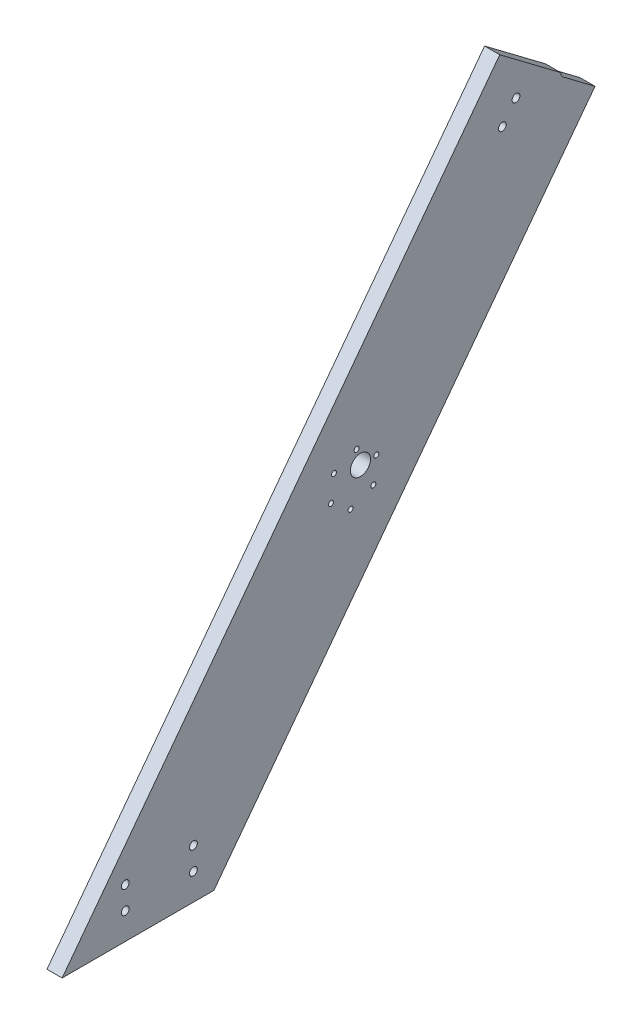
ISO-10303-21;
HEADER;
FILE_DESCRIPTION(('STEP AP214'),'2;1');
FILE_NAME('part.step','',(''),(''),'','','');
FILE_SCHEMA(('AUTOMOTIVE_DESIGN { 1 0 10303 214 1 1 1 1 }'));
ENDSEC;
DATA;
#1=APPLICATION_CONTEXT('core data for automotive mechanical design processes');
#2=APPLICATION_PROTOCOL_DEFINITION('international standard','automotive_design',2000,#1);
#3=PRODUCT_CONTEXT('',#1,'mechanical');
#4=PRODUCT('Part','Part','',(#3));
#5=PRODUCT_RELATED_PRODUCT_CATEGORY('part','',(#4));
#6=PRODUCT_DEFINITION_FORMATION('','',#4);
#7=PRODUCT_DEFINITION_CONTEXT('part definition',#1,'design');
#8=PRODUCT_DEFINITION('design','',#6,#7);
#9=PRODUCT_DEFINITION_SHAPE('','',#8);
#10=(LENGTH_UNIT() NAMED_UNIT(*) SI_UNIT(.MILLI.,.METRE.));
#11=(NAMED_UNIT(*) PLANE_ANGLE_UNIT() SI_UNIT($,.RADIAN.));
#12=(NAMED_UNIT(*) SI_UNIT($,.STERADIAN.) SOLID_ANGLE_UNIT());
#13=UNCERTAINTY_MEASURE_WITH_UNIT(LENGTH_MEASURE(1.E-05),#10,'distance_accuracy_value','');
#14=(GEOMETRIC_REPRESENTATION_CONTEXT(3) GLOBAL_UNCERTAINTY_ASSIGNED_CONTEXT((#13)) GLOBAL_UNIT_ASSIGNED_CONTEXT((#10,
#11,#12)) REPRESENTATION_CONTEXT('',''));
#15=CARTESIAN_POINT('',(0.,0.,0.));
#16=DIRECTION('',(0.,0.,1.));
#17=DIRECTION('',(1.,0.,0.));
#18=AXIS2_PLACEMENT_3D('',#15,#16,#17);
#19=CARTESIAN_POINT('',(9.525,0.,-95.412737151503));
#20=DIRECTION('',(0.,1.,0.));
#21=DIRECTION('',(0.,0.,1.));
#22=AXIS2_PLACEMENT_3D('',#19,#20,#21);
#23=PLANE('',#22);
#24=DIRECTION('',(0.,0.,-1.));
#25=VECTOR('',#24,1.);
#26=CARTESIAN_POINT('',(0.,0.,-95.412737151503));
#27=LINE('',#26,#25);
#28=CARTESIAN_POINT('',(0.,0.,0.));
#29=VERTEX_POINT('',#28);
#30=CARTESIAN_POINT('',(0.,0.,-95.412737151503));
#31=VERTEX_POINT('',#30);
#32=EDGE_CURVE('E123',#29,#31,#27,.T.);
#33=ORIENTED_EDGE('',*,*,#32,.T.);
#34=DIRECTION('',(-1.,0.,0.));
#35=VECTOR('',#34,1.);
#36=CARTESIAN_POINT('',(9.525,0.,-95.412737151503));
#37=LINE('',#36,#35);
#38=CARTESIAN_POINT('',(9.525,0.,-95.412737151503));
#39=VERTEX_POINT('',#38);
#40=EDGE_CURVE('E11',#39,#31,#37,.T.);
#41=ORIENTED_EDGE('',*,*,#40,.F.);
#42=DIRECTION('',(0.,0.,-1.));
#43=VECTOR('',#42,1.);
#44=CARTESIAN_POINT('',(9.525,0.,-95.412737151503));
#45=LINE('',#44,#43);
#46=CARTESIAN_POINT('',(9.525,0.,0.));
#47=VERTEX_POINT('',#46);
#48=EDGE_CURVE('E120',#47,#39,#45,.T.);
#49=ORIENTED_EDGE('',*,*,#48,.F.);
#50=DIRECTION('',(-1.,0.,0.));
#51=VECTOR('',#50,1.);
#52=CARTESIAN_POINT('',(9.525,0.,0.));
#53=LINE('',#52,#51);
#54=EDGE_CURVE('E127',#47,#29,#53,.T.);
#55=ORIENTED_EDGE('',*,*,#54,.T.);
#56=EDGE_LOOP('',(#33,#41,#49,#55));
#57=FACE_BOUND('',#56,.T.);
#58=ADVANCED_FACE('F37',(#57),#23,.F.);
#59=CARTESIAN_POINT('',(9.525,319.277850429435,-336.005854450722));
#60=DIRECTION('',(0.,0.601815023152055,0.798635510047288));
#61=DIRECTION('',(0.,-0.798635510047288,0.601815023152055));
#62=AXIS2_PLACEMENT_3D('',#59,#60,#61);
#63=PLANE('',#62);
#64=DIRECTION('',(0.,0.798635510047288,-0.601815023152055));
#65=VECTOR('',#64,1.);
#66=CARTESIAN_POINT('',(0.,319.277850429435,-336.005854450722));
#67=LINE('',#66,#65);
#68=CARTESIAN_POINT('',(0.,318.010016557235,-335.050473101468));
#69=VERTEX_POINT('',#68);
#70=EDGE_CURVE('E118',#31,#69,#67,.T.);
#71=ORIENTED_EDGE('',*,*,#70,.T.);
#72=DIRECTION('',(1.,0.,0.));
#73=VECTOR('',#72,1.);
#74=CARTESIAN_POINT('',(0.,318.010016557235,-335.050473101468));
#75=LINE('',#74,#73);
#76=CARTESIAN_POINT('',(9.525,318.010016557235,-335.050473101468));
#77=VERTEX_POINT('',#76);
#78=EDGE_CURVE('E134',#69,#77,#75,.T.);
#79=ORIENTED_EDGE('',*,*,#78,.T.);
#80=DIRECTION('',(0.,0.798635510047288,-0.601815023152055));
#81=VECTOR('',#80,1.);
#82=CARTESIAN_POINT('',(9.525,319.277850429435,-336.005854450722));
#83=LINE('',#82,#81);
#84=EDGE_CURVE('E83',#39,#77,#83,.T.);
#85=ORIENTED_EDGE('',*,*,#84,.F.);
#86=ORIENTED_EDGE('',*,*,#40,.T.);
#87=EDGE_LOOP('',(#71,#79,#85,#86));
#88=FACE_BOUND('',#87,.T.);
#89=ADVANCED_FACE('F144',(#88),#63,.F.);
#90=CARTESIAN_POINT('',(9.525,365.136155193621,-275.149828585118));
#91=DIRECTION('',(0.,-0.79863551004729,0.601815023152052));
#92=DIRECTION('',(0.,-0.601815023152052,-0.79863551004729));
#93=AXIS2_PLACEMENT_3D('',#90,#91,#92);
#94=PLANE('',#93);
#95=DIRECTION('',(0.,0.601815023152052,0.79863551004729));
#96=VECTOR('',#95,1.);
#97=CARTESIAN_POINT('',(9.525,365.136155193621,-275.149828585118));
#98=LINE('',#97,#96);
#99=CARTESIAN_POINT('',(9.525,336.218721055008,-313.524559813313));
#100=VERTEX_POINT('',#99);
#101=CARTESIAN_POINT('',(9.525,365.136155193621,-275.149828585118));
#102=VERTEX_POINT('',#101);
#103=EDGE_CURVE('E114',#100,#102,#98,.T.);
#104=ORIENTED_EDGE('',*,*,#103,.F.);
#105=DIRECTION('',(1.,0.,0.));
#106=VECTOR('',#105,1.);
#107=CARTESIAN_POINT('',(0.,336.218721055008,-313.524559813313));
#108=LINE('',#107,#106);
#109=CARTESIAN_POINT('',(0.,336.218721055008,-313.524559813313));
#110=VERTEX_POINT('',#109);
#111=EDGE_CURVE('E102',#110,#100,#108,.T.);
#112=ORIENTED_EDGE('',*,*,#111,.F.);
#113=DIRECTION('',(0.,0.601815023152052,0.79863551004729));
#114=VECTOR('',#113,1.);
#115=CARTESIAN_POINT('',(0.,365.136155193621,-275.149828585118));
#116=LINE('',#115,#114);
#117=CARTESIAN_POINT('',(0.,365.136155193621,-275.149828585118));
#118=VERTEX_POINT('',#117);
#119=EDGE_CURVE('E113',#110,#118,#116,.T.);
#120=ORIENTED_EDGE('',*,*,#119,.T.);
#121=DIRECTION('',(-1.,0.,0.));
#122=VECTOR('',#121,1.);
#123=CARTESIAN_POINT('',(9.525,365.136155193621,-275.149828585118));
#124=LINE('',#123,#122);
#125=EDGE_CURVE('E44',#102,#118,#124,.T.);
#126=ORIENTED_EDGE('',*,*,#125,.F.);
#127=EDGE_LOOP('',(#104,#112,#120,#126));
#128=FACE_BOUND('',#127,.T.);
#129=ADVANCED_FACE('F111',(#128),#94,.F.);
#130=CARTESIAN_POINT('',(9.525,0.,0.));
#131=DIRECTION('',(0.,-0.601815023152052,-0.79863551004729));
#132=DIRECTION('',(0.,0.79863551004729,-0.601815023152052));
#133=AXIS2_PLACEMENT_3D('',#130,#131,#132);
#134=PLANE('',#133);
#135=DIRECTION('',(0.,-0.79863551004729,0.601815023152052));
#136=VECTOR('',#135,1.);
#137=CARTESIAN_POINT('',(0.,0.,0.));
#138=LINE('',#137,#136);
#139=EDGE_CURVE('E77',#118,#29,#138,.T.);
#140=ORIENTED_EDGE('',*,*,#139,.T.);
#141=ORIENTED_EDGE('',*,*,#54,.F.);
#142=DIRECTION('',(0.,-0.79863551004729,0.601815023152052));
#143=VECTOR('',#142,1.);
#144=CARTESIAN_POINT('',(9.525,0.,0.));
#145=LINE('',#144,#143);
#146=EDGE_CURVE('E60',#102,#47,#145,.T.);
#147=ORIENTED_EDGE('',*,*,#146,.F.);
#148=ORIENTED_EDGE('',*,*,#125,.T.);
#149=EDGE_LOOP('',(#140,#141,#147,#148));
#150=FACE_BOUND('',#149,.T.);
#151=ADVANCED_FACE('F128',(#150),#134,.F.);
#152=CARTESIAN_POINT('',(9.525,0.,0.));
#153=DIRECTION('',(-1.,0.,0.));
#154=DIRECTION('',(0.,0.,1.));
#155=AXIS2_PLACEMENT_3D('',#152,#153,#154);
#156=PLANE('',#155);
#157=CARTESIAN_POINT('',(9.525,336.461727915126,-285.346343492198));
#158=DIRECTION('',(1.,0.,0.));
#159=DIRECTION('',(0.,0.,-1.));
#160=AXIS2_PLACEMENT_3D('',#157,#158,#159);
#161=CIRCLE('',#160,2.4638);
#162=CARTESIAN_POINT('',(9.525,336.461727915126,-287.810143492198));
#163=VERTEX_POINT('',#162);
#164=EDGE_CURVE('E214',#163,#163,#161,.T.);
#165=ORIENTED_EDGE('',*,*,#164,.F.);
#166=EDGE_LOOP('',(#165));
#167=FACE_BOUND('',#166,.T.);
#168=CARTESIAN_POINT('',(9.525,16.764,-82.55));
#169=DIRECTION('',(1.,0.,0.));
#170=DIRECTION('',(0.,0.,-1.));
#171=AXIS2_PLACEMENT_3D('',#168,#169,#170);
#172=CIRCLE('',#171,2.4638);
#173=CARTESIAN_POINT('',(9.525,16.764,-85.0138));
#174=VERTEX_POINT('',#173);
#175=EDGE_CURVE('E203',#174,#174,#172,.T.);
#176=ORIENTED_EDGE('',*,*,#175,.F.);
#177=EDGE_LOOP('',(#176));
#178=FACE_BOUND('',#177,.T.);
#179=CARTESIAN_POINT('',(9.525,30.988,-82.55));
#180=DIRECTION('',(1.,0.,0.));
#181=DIRECTION('',(0.,0.,-1.));
#182=AXIS2_PLACEMENT_3D('',#179,#180,#181);
#183=CIRCLE('',#182,2.4638);
#184=CARTESIAN_POINT('',(9.525,30.988,-85.0138));
#185=VERTEX_POINT('',#184);
#186=EDGE_CURVE('E202',#185,#185,#183,.T.);
#187=ORIENTED_EDGE('',*,*,#186,.F.);
#188=EDGE_LOOP('',(#187));
#189=FACE_BOUND('',#188,.T.);
#190=CARTESIAN_POINT('',(9.525,30.988,-39.6875));
#191=DIRECTION('',(1.,0.,0.));
#192=DIRECTION('',(0.,0.,-1.));
#193=AXIS2_PLACEMENT_3D('',#190,#191,#192);
#194=CIRCLE('',#193,2.4638);
#195=CARTESIAN_POINT('',(9.525,30.988,-42.1513));
#196=VERTEX_POINT('',#195);
#197=EDGE_CURVE('E196',#196,#196,#194,.T.);
#198=ORIENTED_EDGE('',*,*,#197,.F.);
#199=EDGE_LOOP('',(#198));
#200=FACE_BOUND('',#199,.T.);
#201=CARTESIAN_POINT('',(9.525,325.101936420213,-276.786126602884));
#202=DIRECTION('',(1.,0.,0.));
#203=DIRECTION('',(0.,0.,-1.));
#204=AXIS2_PLACEMENT_3D('',#201,#202,#203);
#205=CIRCLE('',#204,2.4638);
#206=CARTESIAN_POINT('',(9.525,325.101936420213,-279.249926602884));
#207=VERTEX_POINT('',#206);
#208=EDGE_CURVE('E215',#207,#207,#205,.T.);
#209=ORIENTED_EDGE('',*,*,#208,.F.);
#210=EDGE_LOOP('',(#209));
#211=FACE_BOUND('',#210,.T.);
#212=CARTESIAN_POINT('',(9.525,16.764,-39.6875));
#213=DIRECTION('',(1.,0.,0.));
#214=DIRECTION('',(0.,0.,-1.));
#215=AXIS2_PLACEMENT_3D('',#212,#213,#214);
#216=CIRCLE('',#215,2.4638);
#217=CARTESIAN_POINT('',(9.525,16.764,-42.1513));
#218=VERTEX_POINT('',#217);
#219=EDGE_CURVE('E193',#218,#218,#216,.T.);
#220=ORIENTED_EDGE('',*,*,#219,.F.);
#221=EDGE_LOOP('',(#220));
#222=FACE_BOUND('',#221,.T.);
#223=CARTESIAN_POINT('',(9.525,170.599745201201,-195.663087406095));
#224=DIRECTION('',(1.,0.,0.));
#225=DIRECTION('',(0.,0.,-1.));
#226=AXIS2_PLACEMENT_3D('',#223,#224,#225);
#227=CIRCLE('',#226,1.58749999999996);
#228=CARTESIAN_POINT('',(9.525,170.599745201201,-197.250587406095));
#229=VERTEX_POINT('',#228);
#230=EDGE_CURVE('E176',#229,#229,#227,.T.);
#231=ORIENTED_EDGE('',*,*,#230,.F.);
#232=EDGE_LOOP('',(#231));
#233=FACE_BOUND('',#232,.T.);
#234=CARTESIAN_POINT('',(9.525,164.545757096388,-181.400785206703));
#235=DIRECTION('',(1.,0.,0.));
#236=DIRECTION('',(0.,0.,-1.));
#237=AXIS2_PLACEMENT_3D('',#234,#235,#236);
#238=CIRCLE('',#237,1.58750000000001);
#239=CARTESIAN_POINT('',(9.525,164.545757096388,-182.988285206703));
#240=VERTEX_POINT('',#239);
#241=EDGE_CURVE('E170',#240,#240,#238,.T.);
#242=ORIENTED_EDGE('',*,*,#241,.F.);
#243=EDGE_LOOP('',(#242));
#244=FACE_BOUND('',#243,.T.);
#245=CARTESIAN_POINT('',(9.525,173.870279065106,-169.02672661403));
#246=DIRECTION('',(1.,0.,0.));
#247=DIRECTION('',(0.,0.,-1.));
#248=AXIS2_PLACEMENT_3D('',#245,#246,#247);
#249=CIRCLE('',#248,1.58749999999999);
#250=CARTESIAN_POINT('',(9.525,173.870279065106,-170.61422661403));
#251=VERTEX_POINT('',#250);
#252=EDGE_CURVE('E164',#251,#251,#249,.T.);
#253=ORIENTED_EDGE('',*,*,#252,.F.);
#254=EDGE_LOOP('',(#253));
#255=FACE_BOUND('',#254,.T.);
#256=CARTESIAN_POINT('',(9.525,189.248789138637,-170.91497022075));
#257=DIRECTION('',(1.,0.,0.));
#258=DIRECTION('',(0.,0.,-1.));
#259=AXIS2_PLACEMENT_3D('',#256,#257,#258);
#260=CIRCLE('',#259,1.58749999999999);
#261=CARTESIAN_POINT('',(9.525,189.248789138637,-172.50247022075));
#262=VERTEX_POINT('',#261);
#263=EDGE_CURVE('E157',#262,#262,#260,.T.);
#264=ORIENTED_EDGE('',*,*,#263,.F.);
#265=EDGE_LOOP('',(#264));
#266=FACE_BOUND('',#265,.T.);
#267=CARTESIAN_POINT('',(9.525,195.302777243449,-185.177272420142));
#268=DIRECTION('',(1.,0.,0.));
#269=DIRECTION('',(0.,0.,-1.));
#270=AXIS2_PLACEMENT_3D('',#267,#268,#269);
#271=CIRCLE('',#270,1.58749999999994);
#272=CARTESIAN_POINT('',(9.525,195.302777243449,-186.764772420142));
#273=VERTEX_POINT('',#272);
#274=EDGE_CURVE('E188',#273,#273,#271,.T.);
#275=ORIENTED_EDGE('',*,*,#274,.F.);
#276=EDGE_LOOP('',(#275));
#277=FACE_BOUND('',#276,.T.);
#278=CARTESIAN_POINT('',(9.525,185.978255274732,-197.551331012815));
#279=DIRECTION('',(1.,0.,0.));
#280=DIRECTION('',(0.,0.,-1.));
#281=AXIS2_PLACEMENT_3D('',#278,#279,#280);
#282=CIRCLE('',#281,1.58749999999999);
#283=CARTESIAN_POINT('',(9.525,185.978255274732,-199.138831012815));
#284=VERTEX_POINT('',#283);
#285=EDGE_CURVE('E181',#284,#284,#282,.T.);
#286=ORIENTED_EDGE('',*,*,#285,.F.);
#287=EDGE_LOOP('',(#286));
#288=FACE_BOUND('',#287,.T.);
#289=CARTESIAN_POINT('',(9.525,185.604162917375,-187.56913725808));
#290=DIRECTION('',(1.,0.,0.));
#291=DIRECTION('',(0.,0.,-1.));
#292=AXIS2_PLACEMENT_3D('',#289,#290,#291);
#293=CIRCLE('',#292,6.34999999999999);
#294=CARTESIAN_POINT('',(9.525,185.604162917375,-193.91913725808));
#295=VERTEX_POINT('',#294);
#296=EDGE_CURVE('E150',#295,#295,#293,.T.);
#297=ORIENTED_EDGE('',*,*,#296,.F.);
#298=EDGE_LOOP('',(#297));
#299=FACE_BOUND('',#298,.T.);
#300=ORIENTED_EDGE('',*,*,#84,.T.);
#301=DIRECTION('',(0.,-0.601815023152053,-0.798635510047289));
#302=VECTOR('',#301,1.);
#303=CARTESIAN_POINT('',(9.525,318.010016557235,-335.050473101468));
#304=LINE('',#303,#302);
#305=CARTESIAN_POINT('',(9.525,333.296118145297,-314.765131146267));
#306=VERTEX_POINT('',#305);
#307=EDGE_CURVE('E107',#306,#77,#304,.T.);
#308=ORIENTED_EDGE('',*,*,#307,.F.);
#309=CARTESIAN_POINT('',(9.525,335.831785889697,-316.675893844774));
#310=DIRECTION('',(1.,0.,0.));
#311=DIRECTION('',(0.,0.,-1.));
#312=AXIS2_PLACEMENT_3D('',#309,#310,#311);
#313=CIRCLE('',#312,3.17499999999999);
#314=EDGE_CURVE('E147',#100,#306,#313,.T.);
#315=ORIENTED_EDGE('',*,*,#314,.F.);
#316=ORIENTED_EDGE('',*,*,#103,.T.);
#317=ORIENTED_EDGE('',*,*,#146,.T.);
#318=ORIENTED_EDGE('',*,*,#48,.T.);
#319=EDGE_LOOP('',(#300,#308,#315,#316,#317,#318));
#320=FACE_BOUND('',#319,.T.);
#321=ADVANCED_FACE('F143',(#167,#178,#189,#200,#211,#222,#233,#244,#255,#266,#277,#288,#299,
#320),#156,.F.);
#322=CARTESIAN_POINT('',(0.,0.,0.));
#323=DIRECTION('',(-1.,0.,0.));
#324=DIRECTION('',(0.,0.,1.));
#325=AXIS2_PLACEMENT_3D('',#322,#323,#324);
#326=PLANE('',#325);
#327=CARTESIAN_POINT('',(0.,336.461727915126,-285.346343492198));
#328=DIRECTION('',(1.,0.,0.));
#329=DIRECTION('',(0.,0.,-1.));
#330=AXIS2_PLACEMENT_3D('',#327,#328,#329);
#331=CIRCLE('',#330,2.4638);
#332=CARTESIAN_POINT('',(0.,336.461727915126,-287.810143492198));
#333=VERTEX_POINT('',#332);
#334=EDGE_CURVE('E211',#333,#333,#331,.T.);
#335=ORIENTED_EDGE('',*,*,#334,.T.);
#336=EDGE_LOOP('',(#335));
#337=FACE_BOUND('',#336,.T.);
#338=CARTESIAN_POINT('',(0.,16.764,-82.55));
#339=DIRECTION('',(1.,0.,0.));
#340=DIRECTION('',(0.,0.,-1.));
#341=AXIS2_PLACEMENT_3D('',#338,#339,#340);
#342=CIRCLE('',#341,2.4638);
#343=CARTESIAN_POINT('',(0.,16.764,-85.0138));
#344=VERTEX_POINT('',#343);
#345=EDGE_CURVE('E218',#344,#344,#342,.T.);
#346=ORIENTED_EDGE('',*,*,#345,.T.);
#347=EDGE_LOOP('',(#346));
#348=FACE_BOUND('',#347,.T.);
#349=CARTESIAN_POINT('',(0.,30.988,-82.55));
#350=DIRECTION('',(1.,0.,0.));
#351=DIRECTION('',(0.,0.,-1.));
#352=AXIS2_PLACEMENT_3D('',#349,#350,#351);
#353=CIRCLE('',#352,2.4638);
#354=CARTESIAN_POINT('',(0.,30.988,-85.0138));
#355=VERTEX_POINT('',#354);
#356=EDGE_CURVE('E199',#355,#355,#353,.T.);
#357=ORIENTED_EDGE('',*,*,#356,.T.);
#358=EDGE_LOOP('',(#357));
#359=FACE_BOUND('',#358,.T.);
#360=CARTESIAN_POINT('',(0.,30.988,-39.6875));
#361=DIRECTION('',(1.,0.,0.));
#362=DIRECTION('',(0.,0.,-1.));
#363=AXIS2_PLACEMENT_3D('',#360,#361,#362);
#364=CIRCLE('',#363,2.4638);
#365=CARTESIAN_POINT('',(0.,30.988,-42.1513));
#366=VERTEX_POINT('',#365);
#367=EDGE_CURVE('E206',#366,#366,#364,.T.);
#368=ORIENTED_EDGE('',*,*,#367,.T.);
#369=EDGE_LOOP('',(#368));
#370=FACE_BOUND('',#369,.T.);
#371=CARTESIAN_POINT('',(0.,325.101936420213,-276.786126602884));
#372=DIRECTION('',(1.,0.,0.));
#373=DIRECTION('',(0.,0.,-1.));
#374=AXIS2_PLACEMENT_3D('',#371,#372,#373);
#375=CIRCLE('',#374,2.4638);
#376=CARTESIAN_POINT('',(0.,325.101936420213,-279.249926602884));
#377=VERTEX_POINT('',#376);
#378=EDGE_CURVE('E223',#377,#377,#375,.T.);
#379=ORIENTED_EDGE('',*,*,#378,.T.);
#380=EDGE_LOOP('',(#379));
#381=FACE_BOUND('',#380,.T.);
#382=CARTESIAN_POINT('',(0.,16.764,-39.6875));
#383=DIRECTION('',(1.,0.,0.));
#384=DIRECTION('',(0.,0.,-1.));
#385=AXIS2_PLACEMENT_3D('',#382,#383,#384);
#386=CIRCLE('',#385,2.4638);
#387=CARTESIAN_POINT('',(0.,16.764,-42.1513));
#388=VERTEX_POINT('',#387);
#389=EDGE_CURVE('E185',#388,#388,#386,.T.);
#390=ORIENTED_EDGE('',*,*,#389,.T.);
#391=EDGE_LOOP('',(#390));
#392=FACE_BOUND('',#391,.T.);
#393=CARTESIAN_POINT('',(0.,170.599745201201,-195.663087406095));
#394=DIRECTION('',(1.,0.,0.));
#395=DIRECTION('',(0.,0.,-1.));
#396=AXIS2_PLACEMENT_3D('',#393,#394,#395);
#397=CIRCLE('',#396,1.58749999999996);
#398=CARTESIAN_POINT('',(0.,170.599745201201,-197.250587406095));
#399=VERTEX_POINT('',#398);
#400=EDGE_CURVE('E155',#399,#399,#397,.T.);
#401=ORIENTED_EDGE('',*,*,#400,.T.);
#402=EDGE_LOOP('',(#401));
#403=FACE_BOUND('',#402,.T.);
#404=CARTESIAN_POINT('',(0.,164.545757096388,-181.400785206703));
#405=DIRECTION('',(1.,0.,0.));
#406=DIRECTION('',(0.,0.,-1.));
#407=AXIS2_PLACEMENT_3D('',#404,#405,#406);
#408=CIRCLE('',#407,1.58750000000001);
#409=CARTESIAN_POINT('',(0.,164.545757096388,-182.988285206703));
#410=VERTEX_POINT('',#409);
#411=EDGE_CURVE('E173',#410,#410,#408,.T.);
#412=ORIENTED_EDGE('',*,*,#411,.T.);
#413=EDGE_LOOP('',(#412));
#414=FACE_BOUND('',#413,.T.);
#415=CARTESIAN_POINT('',(0.,173.870279065106,-169.02672661403));
#416=DIRECTION('',(1.,0.,0.));
#417=DIRECTION('',(0.,0.,-1.));
#418=AXIS2_PLACEMENT_3D('',#415,#416,#417);
#419=CIRCLE('',#418,1.58749999999999);
#420=CARTESIAN_POINT('',(0.,173.870279065106,-170.61422661403));
#421=VERTEX_POINT('',#420);
#422=EDGE_CURVE('E167',#421,#421,#419,.T.);
#423=ORIENTED_EDGE('',*,*,#422,.T.);
#424=EDGE_LOOP('',(#423));
#425=FACE_BOUND('',#424,.T.);
#426=CARTESIAN_POINT('',(0.,189.248789138637,-170.91497022075));
#427=DIRECTION('',(1.,0.,0.));
#428=DIRECTION('',(0.,0.,-1.));
#429=AXIS2_PLACEMENT_3D('',#426,#427,#428);
#430=CIRCLE('',#429,1.58749999999999);
#431=CARTESIAN_POINT('',(0.,189.248789138637,-172.50247022075));
#432=VERTEX_POINT('',#431);
#433=EDGE_CURVE('E160',#432,#432,#430,.T.);
#434=ORIENTED_EDGE('',*,*,#433,.T.);
#435=EDGE_LOOP('',(#434));
#436=FACE_BOUND('',#435,.T.);
#437=CARTESIAN_POINT('',(0.,195.302777243449,-185.177272420142));
#438=DIRECTION('',(1.,0.,0.));
#439=DIRECTION('',(0.,0.,-1.));
#440=AXIS2_PLACEMENT_3D('',#437,#438,#439);
#441=CIRCLE('',#440,1.58749999999994);
#442=CARTESIAN_POINT('',(0.,195.302777243449,-186.764772420142));
#443=VERTEX_POINT('',#442);
#444=EDGE_CURVE('E161',#443,#443,#441,.T.);
#445=ORIENTED_EDGE('',*,*,#444,.T.);
#446=EDGE_LOOP('',(#445));
#447=FACE_BOUND('',#446,.T.);
#448=CARTESIAN_POINT('',(0.,185.978255274732,-197.551331012815));
#449=DIRECTION('',(1.,0.,0.));
#450=DIRECTION('',(0.,0.,-1.));
#451=AXIS2_PLACEMENT_3D('',#448,#449,#450);
#452=CIRCLE('',#451,1.58749999999999);
#453=CARTESIAN_POINT('',(0.,185.978255274732,-199.138831012815));
#454=VERTEX_POINT('',#453);
#455=EDGE_CURVE('E184',#454,#454,#452,.T.);
#456=ORIENTED_EDGE('',*,*,#455,.T.);
#457=EDGE_LOOP('',(#456));
#458=FACE_BOUND('',#457,.T.);
#459=CARTESIAN_POINT('',(0.,185.604162917375,-187.56913725808));
#460=DIRECTION('',(1.,0.,0.));
#461=DIRECTION('',(0.,0.,-1.));
#462=AXIS2_PLACEMENT_3D('',#459,#460,#461);
#463=CIRCLE('',#462,6.34999999999999);
#464=CARTESIAN_POINT('',(0.,185.604162917375,-193.91913725808));
#465=VERTEX_POINT('',#464);
#466=EDGE_CURVE('E148',#465,#465,#463,.T.);
#467=ORIENTED_EDGE('',*,*,#466,.T.);
#468=EDGE_LOOP('',(#467));
#469=FACE_BOUND('',#468,.T.);
#470=DIRECTION('',(0.,-0.601815023152053,-0.798635510047289));
#471=VECTOR('',#470,1.);
#472=CARTESIAN_POINT('',(0.,318.010016557235,-335.050473101468));
#473=LINE('',#472,#471);
#474=CARTESIAN_POINT('',(0.,333.296118145297,-314.765131146267));
#475=VERTEX_POINT('',#474);
#476=EDGE_CURVE('E51',#475,#69,#473,.T.);
#477=ORIENTED_EDGE('',*,*,#476,.T.);
#478=ORIENTED_EDGE('',*,*,#70,.F.);
#479=ORIENTED_EDGE('',*,*,#32,.F.);
#480=ORIENTED_EDGE('',*,*,#139,.F.);
#481=ORIENTED_EDGE('',*,*,#119,.F.);
#482=CARTESIAN_POINT('',(0.,335.831785889697,-316.675893844774));
#483=DIRECTION('',(1.,0.,0.));
#484=DIRECTION('',(0.,0.,-1.));
#485=AXIS2_PLACEMENT_3D('',#482,#483,#484);
#486=CIRCLE('',#485,3.17499999999999);
#487=EDGE_CURVE('E98',#110,#475,#486,.T.);
#488=ORIENTED_EDGE('',*,*,#487,.T.);
#489=EDGE_LOOP('',(#477,#478,#479,#480,#481,#488));
#490=FACE_BOUND('',#489,.T.);
#491=ADVANCED_FACE('F116',(#337,#348,#359,#370,#381,#392,#403,#414,#425,#436,#447,#458,#469,
#490),#326,.T.);
#492=CARTESIAN_POINT('',(0.,318.010016557235,-335.050473101468));
#493=DIRECTION('',(0.,-0.798635510047289,0.601815023152053));
#494=DIRECTION('',(0.,-0.601815023152053,-0.798635510047289));
#495=AXIS2_PLACEMENT_3D('',#492,#493,#494);
#496=PLANE('',#495);
#497=ORIENTED_EDGE('',*,*,#307,.T.);
#498=ORIENTED_EDGE('',*,*,#78,.F.);
#499=ORIENTED_EDGE('',*,*,#476,.F.);
#500=DIRECTION('',(1.,0.,0.));
#501=VECTOR('',#500,1.);
#502=CARTESIAN_POINT('',(0.,333.296118145297,-314.765131146267));
#503=LINE('',#502,#501);
#504=EDGE_CURVE('E104',#475,#306,#503,.T.);
#505=ORIENTED_EDGE('',*,*,#504,.T.);
#506=EDGE_LOOP('',(#497,#498,#499,#505));
#507=FACE_BOUND('',#506,.T.);
#508=ADVANCED_FACE('F263',(#507),#496,.F.);
#509=CARTESIAN_POINT('',(0.,335.831785889697,-316.675893844774));
#510=DIRECTION('',(1.,0.,0.));
#511=DIRECTION('',(0.,0.,-1.));
#512=AXIS2_PLACEMENT_3D('',#509,#510,#511);
#513=CYLINDRICAL_SURFACE('',#512,3.17499999999999);
#514=ORIENTED_EDGE('',*,*,#314,.T.);
#515=ORIENTED_EDGE('',*,*,#504,.F.);
#516=ORIENTED_EDGE('',*,*,#487,.F.);
#517=ORIENTED_EDGE('',*,*,#111,.T.);
#518=EDGE_LOOP('',(#514,#515,#516,#517));
#519=FACE_BOUND('',#518,.T.);
#520=ADVANCED_FACE('F101',(#519),#513,.F.);
#521=CARTESIAN_POINT('',(0.,185.604162917375,-187.56913725808));
#522=DIRECTION('',(1.,0.,0.));
#523=DIRECTION('',(0.,0.,-1.));
#524=AXIS2_PLACEMENT_3D('',#521,#522,#523);
#525=CYLINDRICAL_SURFACE('',#524,6.34999999999999);
#526=ORIENTED_EDGE('',*,*,#466,.F.);
#527=EDGE_LOOP('',(#526));
#528=FACE_BOUND('',#527,.T.);
#529=ORIENTED_EDGE('',*,*,#296,.T.);
#530=EDGE_LOOP('',(#529));
#531=FACE_BOUND('',#530,.T.);
#532=ADVANCED_FACE('F251',(#528,#531),#525,.F.);
#533=CARTESIAN_POINT('',(0.,185.978255274732,-197.551331012815));
#534=DIRECTION('',(1.,0.,0.));
#535=DIRECTION('',(0.,0.,-1.));
#536=AXIS2_PLACEMENT_3D('',#533,#534,#535);
#537=CYLINDRICAL_SURFACE('',#536,1.58749999999999);
#538=ORIENTED_EDGE('',*,*,#455,.F.);
#539=EDGE_LOOP('',(#538));
#540=FACE_BOUND('',#539,.T.);
#541=ORIENTED_EDGE('',*,*,#285,.T.);
#542=EDGE_LOOP('',(#541));
#543=FACE_BOUND('',#542,.T.);
#544=ADVANCED_FACE('F253',(#540,#543),#537,.F.);
#545=CARTESIAN_POINT('',(0.,195.302777243449,-185.177272420142));
#546=DIRECTION('',(1.,0.,0.));
#547=DIRECTION('',(0.,0.,-1.));
#548=AXIS2_PLACEMENT_3D('',#545,#546,#547);
#549=CYLINDRICAL_SURFACE('',#548,1.58749999999994);
#550=ORIENTED_EDGE('',*,*,#444,.F.);
#551=EDGE_LOOP('',(#550));
#552=FACE_BOUND('',#551,.T.);
#553=ORIENTED_EDGE('',*,*,#274,.T.);
#554=EDGE_LOOP('',(#553));
#555=FACE_BOUND('',#554,.T.);
#556=ADVANCED_FACE('F260',(#552,#555),#549,.F.);
#557=CARTESIAN_POINT('',(0.,189.248789138637,-170.91497022075));
#558=DIRECTION('',(1.,0.,0.));
#559=DIRECTION('',(0.,0.,-1.));
#560=AXIS2_PLACEMENT_3D('',#557,#558,#559);
#561=CYLINDRICAL_SURFACE('',#560,1.58749999999999);
#562=ORIENTED_EDGE('',*,*,#433,.F.);
#563=EDGE_LOOP('',(#562));
#564=FACE_BOUND('',#563,.T.);
#565=ORIENTED_EDGE('',*,*,#263,.T.);
#566=EDGE_LOOP('',(#565));
#567=FACE_BOUND('',#566,.T.);
#568=ADVANCED_FACE('F309',(#564,#567),#561,.F.);
#569=CARTESIAN_POINT('',(0.,173.870279065106,-169.02672661403));
#570=DIRECTION('',(1.,0.,0.));
#571=DIRECTION('',(0.,0.,-1.));
#572=AXIS2_PLACEMENT_3D('',#569,#570,#571);
#573=CYLINDRICAL_SURFACE('',#572,1.58749999999999);
#574=ORIENTED_EDGE('',*,*,#422,.F.);
#575=EDGE_LOOP('',(#574));
#576=FACE_BOUND('',#575,.T.);
#577=ORIENTED_EDGE('',*,*,#252,.T.);
#578=EDGE_LOOP('',(#577));
#579=FACE_BOUND('',#578,.T.);
#580=ADVANCED_FACE('F319',(#576,#579),#573,.F.);
#581=CARTESIAN_POINT('',(0.,164.545757096388,-181.400785206703));
#582=DIRECTION('',(1.,0.,0.));
#583=DIRECTION('',(0.,0.,-1.));
#584=AXIS2_PLACEMENT_3D('',#581,#582,#583);
#585=CYLINDRICAL_SURFACE('',#584,1.58750000000001);
#586=ORIENTED_EDGE('',*,*,#411,.F.);
#587=EDGE_LOOP('',(#586));
#588=FACE_BOUND('',#587,.T.);
#589=ORIENTED_EDGE('',*,*,#241,.T.);
#590=EDGE_LOOP('',(#589));
#591=FACE_BOUND('',#590,.T.);
#592=ADVANCED_FACE('F328',(#588,#591),#585,.F.);
#593=CARTESIAN_POINT('',(0.,170.599745201201,-195.663087406095));
#594=DIRECTION('',(1.,0.,0.));
#595=DIRECTION('',(0.,0.,-1.));
#596=AXIS2_PLACEMENT_3D('',#593,#594,#595);
#597=CYLINDRICAL_SURFACE('',#596,1.58749999999996);
#598=ORIENTED_EDGE('',*,*,#400,.F.);
#599=EDGE_LOOP('',(#598));
#600=FACE_BOUND('',#599,.T.);
#601=ORIENTED_EDGE('',*,*,#230,.T.);
#602=EDGE_LOOP('',(#601));
#603=FACE_BOUND('',#602,.T.);
#604=ADVANCED_FACE('F338',(#600,#603),#597,.F.);
#605=CARTESIAN_POINT('',(0.,16.764,-39.6875));
#606=DIRECTION('',(1.,0.,0.));
#607=DIRECTION('',(0.,0.,-1.));
#608=AXIS2_PLACEMENT_3D('',#605,#606,#607);
#609=CYLINDRICAL_SURFACE('',#608,2.4638);
#610=ORIENTED_EDGE('',*,*,#389,.F.);
#611=EDGE_LOOP('',(#610));
#612=FACE_BOUND('',#611,.T.);
#613=ORIENTED_EDGE('',*,*,#219,.T.);
#614=EDGE_LOOP('',(#613));
#615=FACE_BOUND('',#614,.T.);
#616=ADVANCED_FACE('F348',(#612,#615),#609,.F.);
#617=CARTESIAN_POINT('',(0.,325.101936420213,-276.786126602884));
#618=DIRECTION('',(1.,0.,0.));
#619=DIRECTION('',(0.,0.,-1.));
#620=AXIS2_PLACEMENT_3D('',#617,#618,#619);
#621=CYLINDRICAL_SURFACE('',#620,2.4638);
#622=ORIENTED_EDGE('',*,*,#378,.F.);
#623=EDGE_LOOP('',(#622));
#624=FACE_BOUND('',#623,.T.);
#625=ORIENTED_EDGE('',*,*,#208,.T.);
#626=EDGE_LOOP('',(#625));
#627=FACE_BOUND('',#626,.T.);
#628=ADVANCED_FACE('F229',(#624,#627),#621,.F.);
#629=CARTESIAN_POINT('',(0.,30.988,-39.6875));
#630=DIRECTION('',(1.,0.,0.));
#631=DIRECTION('',(0.,0.,-1.));
#632=AXIS2_PLACEMENT_3D('',#629,#630,#631);
#633=CYLINDRICAL_SURFACE('',#632,2.4638);
#634=ORIENTED_EDGE('',*,*,#367,.F.);
#635=EDGE_LOOP('',(#634));
#636=FACE_BOUND('',#635,.T.);
#637=ORIENTED_EDGE('',*,*,#197,.T.);
#638=EDGE_LOOP('',(#637));
#639=FACE_BOUND('',#638,.T.);
#640=ADVANCED_FACE('F378',(#636,#639),#633,.F.);
#641=CARTESIAN_POINT('',(0.,30.988,-82.55));
#642=DIRECTION('',(1.,0.,0.));
#643=DIRECTION('',(0.,0.,-1.));
#644=AXIS2_PLACEMENT_3D('',#641,#642,#643);
#645=CYLINDRICAL_SURFACE('',#644,2.4638);
#646=ORIENTED_EDGE('',*,*,#356,.F.);
#647=EDGE_LOOP('',(#646));
#648=FACE_BOUND('',#647,.T.);
#649=ORIENTED_EDGE('',*,*,#186,.T.);
#650=EDGE_LOOP('',(#649));
#651=FACE_BOUND('',#650,.T.);
#652=ADVANCED_FACE('F388',(#648,#651),#645,.F.);
#653=CARTESIAN_POINT('',(0.,16.764,-82.55));
#654=DIRECTION('',(1.,0.,0.));
#655=DIRECTION('',(0.,0.,-1.));
#656=AXIS2_PLACEMENT_3D('',#653,#654,#655);
#657=CYLINDRICAL_SURFACE('',#656,2.4638);
#658=ORIENTED_EDGE('',*,*,#345,.F.);
#659=EDGE_LOOP('',(#658));
#660=FACE_BOUND('',#659,.T.);
#661=ORIENTED_EDGE('',*,*,#175,.T.);
#662=EDGE_LOOP('',(#661));
#663=FACE_BOUND('',#662,.T.);
#664=ADVANCED_FACE('F398',(#660,#663),#657,.F.);
#665=CARTESIAN_POINT('',(0.,336.461727915126,-285.346343492198));
#666=DIRECTION('',(1.,0.,0.));
#667=DIRECTION('',(0.,0.,-1.));
#668=AXIS2_PLACEMENT_3D('',#665,#666,#667);
#669=CYLINDRICAL_SURFACE('',#668,2.4638);
#670=ORIENTED_EDGE('',*,*,#334,.F.);
#671=EDGE_LOOP('',(#670));
#672=FACE_BOUND('',#671,.T.);
#673=ORIENTED_EDGE('',*,*,#164,.T.);
#674=EDGE_LOOP('',(#673));
#675=FACE_BOUND('',#674,.T.);
#676=ADVANCED_FACE('F408',(#672,#675),#669,.F.);
#677=CLOSED_SHELL('',(#58,#89,#129,#151,#321,#491,#508,#520,#532,#544,#556,#568,#580,#592,#604,
#616,#628,#640,#652,#664,#676));
#678=MANIFOLD_SOLID_BREP('B2',#677);
#679=ADVANCED_BREP_SHAPE_REPRESENTATION('',(#18,#678),#14);
#680=SHAPE_DEFINITION_REPRESENTATION(#9,#679);
ENDSEC;
END-ISO-10303-21;
